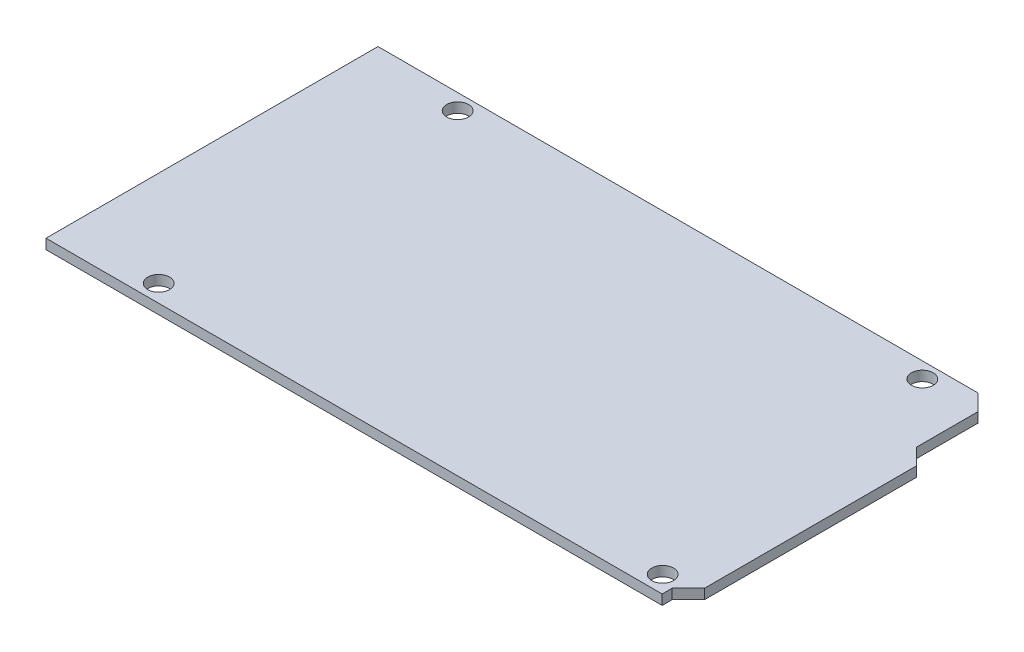
ISO-10303-21;
HEADER;
FILE_DESCRIPTION(('STEP AP214'),'2;1');
FILE_NAME('part.step','',(''),(''),'','','');
FILE_SCHEMA(('AUTOMOTIVE_DESIGN { 1 0 10303 214 1 1 1 1 }'));
ENDSEC;
DATA;
#1=APPLICATION_CONTEXT('core data for automotive mechanical design processes');
#2=APPLICATION_PROTOCOL_DEFINITION('international standard','automotive_design',2000,#1);
#3=PRODUCT_CONTEXT('',#1,'mechanical');
#4=PRODUCT('Part','Part','',(#3));
#5=PRODUCT_RELATED_PRODUCT_CATEGORY('part','',(#4));
#6=PRODUCT_DEFINITION_FORMATION('','',#4);
#7=PRODUCT_DEFINITION_CONTEXT('part definition',#1,'design');
#8=PRODUCT_DEFINITION('design','',#6,#7);
#9=PRODUCT_DEFINITION_SHAPE('','',#8);
#10=(LENGTH_UNIT() NAMED_UNIT(*) SI_UNIT(.MILLI.,.METRE.));
#11=(NAMED_UNIT(*) PLANE_ANGLE_UNIT() SI_UNIT($,.RADIAN.));
#12=(NAMED_UNIT(*) SI_UNIT($,.STERADIAN.) SOLID_ANGLE_UNIT());
#13=UNCERTAINTY_MEASURE_WITH_UNIT(LENGTH_MEASURE(1.E-05),#10,'distance_accuracy_value','');
#14=(GEOMETRIC_REPRESENTATION_CONTEXT(3) GLOBAL_UNCERTAINTY_ASSIGNED_CONTEXT((#13)) GLOBAL_UNIT_ASSIGNED_CONTEXT((#10,
#11,#12)) REPRESENTATION_CONTEXT('',''));
#15=CARTESIAN_POINT('',(0.,0.,0.));
#16=DIRECTION('',(0.,0.,1.));
#17=DIRECTION('',(1.,0.,0.));
#18=AXIS2_PLACEMENT_3D('',#15,#16,#17);
#19=CARTESIAN_POINT('',(48.2000000000001,1.6,25.0700000000001));
#20=DIRECTION('',(-0.707106781186566,0.,-0.707106781186529));
#21=DIRECTION('',(-0.707106781186529,0.,0.707106781186566));
#22=AXIS2_PLACEMENT_3D('',#19,#20,#21);
#23=PLANE('',#22);
#24=DIRECTION('',(0.707106781186529,0.,-0.707106781186566));
#25=VECTOR('',#24,1.);
#26=CARTESIAN_POINT('',(48.2000000000001,0.,25.0700000000001));
#27=LINE('',#26,#25);
#28=CARTESIAN_POINT('',(48.2000000000001,0.,25.0700000000001));
#29=VERTEX_POINT('',#28);
#30=CARTESIAN_POINT('',(50.8,0.,22.47));
#31=VERTEX_POINT('',#30);
#32=EDGE_CURVE('E142',#29,#31,#27,.T.);
#33=ORIENTED_EDGE('',*,*,#32,.T.);
#34=DIRECTION('',(0.,-1.,0.));
#35=VECTOR('',#34,1.);
#36=CARTESIAN_POINT('',(50.8,1.6,22.47));
#37=LINE('',#36,#35);
#38=CARTESIAN_POINT('',(50.8,1.6,22.47));
#39=VERTEX_POINT('',#38);
#40=EDGE_CURVE('E11',#39,#31,#37,.T.);
#41=ORIENTED_EDGE('',*,*,#40,.F.);
#42=DIRECTION('',(0.707106781186529,0.,-0.707106781186566));
#43=VECTOR('',#42,1.);
#44=CARTESIAN_POINT('',(48.2000000000001,1.6,25.0700000000001));
#45=LINE('',#44,#43);
#46=CARTESIAN_POINT('',(48.2000000000001,1.6,25.0700000000001));
#47=VERTEX_POINT('',#46);
#48=EDGE_CURVE('E159',#47,#39,#45,.T.);
#49=ORIENTED_EDGE('',*,*,#48,.F.);
#50=DIRECTION('',(0.,-1.,0.));
#51=VECTOR('',#50,1.);
#52=CARTESIAN_POINT('',(48.2000000000001,1.6,25.0700000000001));
#53=LINE('',#52,#51);
#54=EDGE_CURVE('E138',#47,#29,#53,.T.);
#55=ORIENTED_EDGE('',*,*,#54,.T.);
#56=EDGE_LOOP('',(#33,#41,#49,#55));
#57=FACE_BOUND('',#56,.T.);
#58=ADVANCED_FACE('F38',(#57),#23,.F.);
#59=CARTESIAN_POINT('',(50.8,1.6,22.47));
#60=DIRECTION('',(-1.,0.,0.));
#61=DIRECTION('',(0.,0.,1.));
#62=AXIS2_PLACEMENT_3D('',#59,#60,#61);
#63=PLANE('',#62);
#64=DIRECTION('',(0.,0.,-1.));
#65=VECTOR('',#64,1.);
#66=CARTESIAN_POINT('',(50.8,0.,22.47));
#67=LINE('',#66,#65);
#68=CARTESIAN_POINT('',(50.8,0.,-11.5868711410477));
#69=VERTEX_POINT('',#68);
#70=EDGE_CURVE('E145',#31,#69,#67,.T.);
#71=ORIENTED_EDGE('',*,*,#70,.T.);
#72=DIRECTION('',(0.,-1.,0.));
#73=VECTOR('',#72,1.);
#74=CARTESIAN_POINT('',(50.8,1.6,-11.5868711410477));
#75=LINE('',#74,#73);
#76=CARTESIAN_POINT('',(50.8,1.6,-11.5868711410477));
#77=VERTEX_POINT('',#76);
#78=EDGE_CURVE('E47',#77,#69,#75,.T.);
#79=ORIENTED_EDGE('',*,*,#78,.F.);
#80=DIRECTION('',(0.,0.,-1.));
#81=VECTOR('',#80,1.);
#82=CARTESIAN_POINT('',(50.8,1.6,22.47));
#83=LINE('',#82,#81);
#84=EDGE_CURVE('E102',#39,#77,#83,.T.);
#85=ORIENTED_EDGE('',*,*,#84,.F.);
#86=ORIENTED_EDGE('',*,*,#40,.T.);
#87=EDGE_LOOP('',(#71,#79,#85,#86));
#88=FACE_BOUND('',#87,.T.);
#89=ADVANCED_FACE('F234',(#88),#63,.F.);
#90=CARTESIAN_POINT('',(50.8,1.6,-11.5868711410477));
#91=DIRECTION('',(-0.707106781186548,0.,0.707106781186548));
#92=DIRECTION('',(0.707106781186548,0.,0.707106781186548));
#93=AXIS2_PLACEMENT_3D('',#90,#91,#92);
#94=PLANE('',#93);
#95=DIRECTION('',(-0.707106781186547,0.,-0.707106781186547));
#96=VECTOR('',#95,1.);
#97=CARTESIAN_POINT('',(50.8,0.,-11.5868711410477));
#98=LINE('',#97,#96);
#99=CARTESIAN_POINT('',(48.2,0.,-14.1868711410477));
#100=VERTEX_POINT('',#99);
#101=EDGE_CURVE('E148',#69,#100,#98,.T.);
#102=ORIENTED_EDGE('',*,*,#101,.T.);
#103=DIRECTION('',(0.,-1.,0.));
#104=VECTOR('',#103,1.);
#105=CARTESIAN_POINT('',(48.2,1.6,-14.1868711410477));
#106=LINE('',#105,#104);
#107=CARTESIAN_POINT('',(48.2,1.6,-14.1868711410477));
#108=VERTEX_POINT('',#107);
#109=EDGE_CURVE('E169',#108,#100,#106,.T.);
#110=ORIENTED_EDGE('',*,*,#109,.F.);
#111=DIRECTION('',(-0.707106781186547,0.,-0.707106781186547));
#112=VECTOR('',#111,1.);
#113=CARTESIAN_POINT('',(50.8,1.6,-11.5868711410477));
#114=LINE('',#113,#112);
#115=EDGE_CURVE('E199',#77,#108,#114,.T.);
#116=ORIENTED_EDGE('',*,*,#115,.F.);
#117=ORIENTED_EDGE('',*,*,#78,.T.);
#118=EDGE_LOOP('',(#102,#110,#116,#117));
#119=FACE_BOUND('',#118,.T.);
#120=ADVANCED_FACE('F238',(#119),#94,.F.);
#121=CARTESIAN_POINT('',(48.2,1.6,-24.0700000000001));
#122=DIRECTION('',(-1.,0.,0.));
#123=DIRECTION('',(0.,0.,1.));
#124=AXIS2_PLACEMENT_3D('',#121,#122,#123);
#125=PLANE('',#124);
#126=DIRECTION('',(0.,0.,-1.));
#127=VECTOR('',#126,1.);
#128=CARTESIAN_POINT('',(48.2,0.,-24.0700000000001));
#129=LINE('',#128,#127);
#130=CARTESIAN_POINT('',(48.2,0.,-24.0700000000001));
#131=VERTEX_POINT('',#130);
#132=EDGE_CURVE('E150',#100,#131,#129,.T.);
#133=ORIENTED_EDGE('',*,*,#132,.T.);
#134=DIRECTION('',(0.,-1.,0.));
#135=VECTOR('',#134,1.);
#136=CARTESIAN_POINT('',(48.2,1.6,-24.0700000000001));
#137=LINE('',#136,#135);
#138=CARTESIAN_POINT('',(48.2,1.6,-24.0700000000001));
#139=VERTEX_POINT('',#138);
#140=EDGE_CURVE('E166',#139,#131,#137,.T.);
#141=ORIENTED_EDGE('',*,*,#140,.F.);
#142=DIRECTION('',(0.,0.,-1.));
#143=VECTOR('',#142,1.);
#144=CARTESIAN_POINT('',(48.2,1.6,-24.0700000000001));
#145=LINE('',#144,#143);
#146=EDGE_CURVE('E201',#108,#139,#145,.T.);
#147=ORIENTED_EDGE('',*,*,#146,.F.);
#148=ORIENTED_EDGE('',*,*,#109,.T.);
#149=EDGE_LOOP('',(#133,#141,#147,#148));
#150=FACE_BOUND('',#149,.T.);
#151=ADVANCED_FACE('F242',(#150),#125,.F.);
#152=CARTESIAN_POINT('',(45.6,1.6,-26.67));
#153=DIRECTION('',(-0.707106781186543,0.,0.707106781186552));
#154=DIRECTION('',(0.707106781186552,0.,0.707106781186543));
#155=AXIS2_PLACEMENT_3D('',#152,#153,#154);
#156=PLANE('',#155);
#157=DIRECTION('',(-0.707106781186552,0.,-0.707106781186543));
#158=VECTOR('',#157,1.);
#159=CARTESIAN_POINT('',(45.6,0.,-26.67));
#160=LINE('',#159,#158);
#161=CARTESIAN_POINT('',(45.6,0.,-26.67));
#162=VERTEX_POINT('',#161);
#163=EDGE_CURVE('E152',#131,#162,#160,.T.);
#164=ORIENTED_EDGE('',*,*,#163,.T.);
#165=DIRECTION('',(0.,-1.,0.));
#166=VECTOR('',#165,1.);
#167=CARTESIAN_POINT('',(45.6,1.6,-26.67));
#168=LINE('',#167,#166);
#169=CARTESIAN_POINT('',(45.6,1.6,-26.67));
#170=VERTEX_POINT('',#169);
#171=EDGE_CURVE('E163',#170,#162,#168,.T.);
#172=ORIENTED_EDGE('',*,*,#171,.F.);
#173=DIRECTION('',(-0.707106781186552,0.,-0.707106781186543));
#174=VECTOR('',#173,1.);
#175=CARTESIAN_POINT('',(45.6,1.6,-26.67));
#176=LINE('',#175,#174);
#177=EDGE_CURVE('E203',#139,#170,#176,.T.);
#178=ORIENTED_EDGE('',*,*,#177,.F.);
#179=ORIENTED_EDGE('',*,*,#140,.T.);
#180=EDGE_LOOP('',(#164,#172,#178,#179));
#181=FACE_BOUND('',#180,.T.);
#182=ADVANCED_FACE('F209',(#181),#156,.F.);
#183=CARTESIAN_POINT('',(45.6,1.6,-26.67));
#184=DIRECTION('',(0.,0.,1.));
#185=DIRECTION('',(1.,0.,0.));
#186=AXIS2_PLACEMENT_3D('',#183,#184,#185);
#187=PLANE('',#186);
#188=DIRECTION('',(-1.,0.,0.));
#189=VECTOR('',#188,1.);
#190=CARTESIAN_POINT('',(45.6,0.,-26.67));
#191=LINE('',#190,#189);
#192=CARTESIAN_POINT('',(-50.8,0.,-26.67));
#193=VERTEX_POINT('',#192);
#194=EDGE_CURVE('E154',#162,#193,#191,.T.);
#195=ORIENTED_EDGE('',*,*,#194,.T.);
#196=DIRECTION('',(0.,-1.,0.));
#197=VECTOR('',#196,1.);
#198=CARTESIAN_POINT('',(-50.8,1.6,-26.67));
#199=LINE('',#198,#197);
#200=CARTESIAN_POINT('',(-50.8,1.6,-26.67));
#201=VERTEX_POINT('',#200);
#202=EDGE_CURVE('E133',#201,#193,#199,.T.);
#203=ORIENTED_EDGE('',*,*,#202,.F.);
#204=DIRECTION('',(-1.,0.,0.));
#205=VECTOR('',#204,1.);
#206=CARTESIAN_POINT('',(45.6,1.6,-26.67));
#207=LINE('',#206,#205);
#208=EDGE_CURVE('E124',#170,#201,#207,.T.);
#209=ORIENTED_EDGE('',*,*,#208,.F.);
#210=ORIENTED_EDGE('',*,*,#171,.T.);
#211=EDGE_LOOP('',(#195,#203,#209,#210));
#212=FACE_BOUND('',#211,.T.);
#213=ADVANCED_FACE('F213',(#212),#187,.F.);
#214=CARTESIAN_POINT('',(-50.8,1.6,26.67));
#215=DIRECTION('',(1.,0.,0.));
#216=DIRECTION('',(0.,0.,-1.));
#217=AXIS2_PLACEMENT_3D('',#214,#215,#216);
#218=PLANE('',#217);
#219=DIRECTION('',(0.,0.,1.));
#220=VECTOR('',#219,1.);
#221=CARTESIAN_POINT('',(-50.8,0.,26.67));
#222=LINE('',#221,#220);
#223=CARTESIAN_POINT('',(-50.8,0.,26.67));
#224=VERTEX_POINT('',#223);
#225=EDGE_CURVE('E132',#193,#224,#222,.T.);
#226=ORIENTED_EDGE('',*,*,#225,.T.);
#227=DIRECTION('',(0.,-1.,0.));
#228=VECTOR('',#227,1.);
#229=CARTESIAN_POINT('',(-50.8,1.6,26.67));
#230=LINE('',#229,#228);
#231=CARTESIAN_POINT('',(-50.8,1.6,26.67));
#232=VERTEX_POINT('',#231);
#233=EDGE_CURVE('E129',#232,#224,#230,.T.);
#234=ORIENTED_EDGE('',*,*,#233,.F.);
#235=DIRECTION('',(0.,0.,1.));
#236=VECTOR('',#235,1.);
#237=CARTESIAN_POINT('',(-50.8,1.6,26.67));
#238=LINE('',#237,#236);
#239=EDGE_CURVE('E118',#201,#232,#238,.T.);
#240=ORIENTED_EDGE('',*,*,#239,.F.);
#241=ORIENTED_EDGE('',*,*,#202,.T.);
#242=EDGE_LOOP('',(#226,#234,#240,#241));
#243=FACE_BOUND('',#242,.T.);
#244=ADVANCED_FACE('F130',(#243),#218,.F.);
#245=CARTESIAN_POINT('',(48.2000000000001,1.6,26.6700000000001));
#246=DIRECTION('',(0.,0.,-1.));
#247=DIRECTION('',(-1.,0.,0.));
#248=AXIS2_PLACEMENT_3D('',#245,#246,#247);
#249=PLANE('',#248);
#250=DIRECTION('',(1.,0.,0.));
#251=VECTOR('',#250,1.);
#252=CARTESIAN_POINT('',(48.2000000000001,0.,26.6700000000001));
#253=LINE('',#252,#251);
#254=CARTESIAN_POINT('',(48.2000000000001,0.,26.6700000000001));
#255=VERTEX_POINT('',#254);
#256=EDGE_CURVE('E88',#224,#255,#253,.T.);
#257=ORIENTED_EDGE('',*,*,#256,.T.);
#258=DIRECTION('',(0.,-1.,0.));
#259=VECTOR('',#258,1.);
#260=CARTESIAN_POINT('',(48.2000000000001,1.6,26.6700000000001));
#261=LINE('',#260,#259);
#262=CARTESIAN_POINT('',(48.2000000000001,1.6,26.6700000000001));
#263=VERTEX_POINT('',#262);
#264=EDGE_CURVE('E134',#263,#255,#261,.T.);
#265=ORIENTED_EDGE('',*,*,#264,.F.);
#266=DIRECTION('',(1.,0.,0.));
#267=VECTOR('',#266,1.);
#268=CARTESIAN_POINT('',(48.2000000000001,1.6,26.6700000000001));
#269=LINE('',#268,#267);
#270=EDGE_CURVE('E122',#232,#263,#269,.T.);
#271=ORIENTED_EDGE('',*,*,#270,.F.);
#272=ORIENTED_EDGE('',*,*,#233,.T.);
#273=EDGE_LOOP('',(#257,#265,#271,#272));
#274=FACE_BOUND('',#273,.T.);
#275=ADVANCED_FACE('F136',(#274),#249,.F.);
#276=CARTESIAN_POINT('',(48.2000000000001,1.6,25.0700000000001));
#277=DIRECTION('',(-1.,0.,0.));
#278=DIRECTION('',(0.,0.,1.));
#279=AXIS2_PLACEMENT_3D('',#276,#277,#278);
#280=PLANE('',#279);
#281=DIRECTION('',(0.,0.,-1.));
#282=VECTOR('',#281,1.);
#283=CARTESIAN_POINT('',(48.2000000000001,0.,25.0700000000001));
#284=LINE('',#283,#282);
#285=EDGE_CURVE('E94',#255,#29,#284,.T.);
#286=ORIENTED_EDGE('',*,*,#285,.T.);
#287=ORIENTED_EDGE('',*,*,#54,.F.);
#288=DIRECTION('',(0.,0.,-1.));
#289=VECTOR('',#288,1.);
#290=CARTESIAN_POINT('',(48.2000000000001,1.6,25.0700000000001));
#291=LINE('',#290,#289);
#292=EDGE_CURVE('E56',#263,#47,#291,.T.);
#293=ORIENTED_EDGE('',*,*,#292,.F.);
#294=ORIENTED_EDGE('',*,*,#264,.T.);
#295=EDGE_LOOP('',(#286,#287,#293,#294));
#296=FACE_BOUND('',#295,.T.);
#297=ADVANCED_FACE('F221',(#296),#280,.F.);
#298=CARTESIAN_POINT('',(67.8284355705234,1.6,5.44156442947573));
#299=DIRECTION('',(0.,1.,0.));
#300=DIRECTION('',(0.,0.,1.));
#301=AXIS2_PLACEMENT_3D('',#298,#299,#300);
#302=PLANE('',#301);
#303=CARTESIAN_POINT('',(-35.4684388441213,1.6,-24.1322547617535));
#304=DIRECTION('',(0.,1.,0.));
#305=DIRECTION('',(0.,0.,1.));
#306=AXIS2_PLACEMENT_3D('',#303,#304,#305);
#307=CIRCLE('',#306,1.75);
#308=CARTESIAN_POINT('',(-35.4684388441213,1.6,-22.3822547617534));
#309=VERTEX_POINT('',#308);
#310=EDGE_CURVE('E192',#309,#309,#307,.T.);
#311=ORIENTED_EDGE('',*,*,#310,.F.);
#312=EDGE_LOOP('',(#311));
#313=FACE_BOUND('',#312,.T.);
#314=CARTESIAN_POINT('',(-35.4684388441213,1.6,23.8988818579047));
#315=DIRECTION('',(0.,1.,0.));
#316=DIRECTION('',(0.,0.,1.));
#317=AXIS2_PLACEMENT_3D('',#314,#315,#316);
#318=CIRCLE('',#317,1.75);
#319=CARTESIAN_POINT('',(-35.4684388441213,1.6,25.6488818579047));
#320=VERTEX_POINT('',#319);
#321=EDGE_CURVE('E182',#320,#320,#318,.T.);
#322=ORIENTED_EDGE('',*,*,#321,.F.);
#323=EDGE_LOOP('',(#322));
#324=FACE_BOUND('',#323,.T.);
#325=CARTESIAN_POINT('',(45.5029282232194,1.6,23.8988818579047));
#326=DIRECTION('',(0.,1.,0.));
#327=DIRECTION('',(0.,0.,1.));
#328=AXIS2_PLACEMENT_3D('',#325,#326,#327);
#329=CIRCLE('',#328,1.75);
#330=CARTESIAN_POINT('',(45.5029282232194,1.6,25.6488818579047));
#331=VERTEX_POINT('',#330);
#332=EDGE_CURVE('E179',#331,#331,#329,.T.);
#333=ORIENTED_EDGE('',*,*,#332,.F.);
#334=EDGE_LOOP('',(#333));
#335=FACE_BOUND('',#334,.T.);
#336=CARTESIAN_POINT('',(39.195511541846,1.6,-24.1322547617535));
#337=DIRECTION('',(0.,1.,0.));
#338=DIRECTION('',(0.,0.,1.));
#339=AXIS2_PLACEMENT_3D('',#336,#337,#338);
#340=CIRCLE('',#339,1.75);
#341=CARTESIAN_POINT('',(39.195511541846,1.6,-22.3822547617534));
#342=VERTEX_POINT('',#341);
#343=EDGE_CURVE('E176',#342,#342,#340,.T.);
#344=ORIENTED_EDGE('',*,*,#343,.F.);
#345=EDGE_LOOP('',(#344));
#346=FACE_BOUND('',#345,.T.);
#347=ORIENTED_EDGE('',*,*,#48,.T.);
#348=ORIENTED_EDGE('',*,*,#84,.T.);
#349=ORIENTED_EDGE('',*,*,#115,.T.);
#350=ORIENTED_EDGE('',*,*,#146,.T.);
#351=ORIENTED_EDGE('',*,*,#177,.T.);
#352=ORIENTED_EDGE('',*,*,#208,.T.);
#353=ORIENTED_EDGE('',*,*,#239,.T.);
#354=ORIENTED_EDGE('',*,*,#270,.T.);
#355=ORIENTED_EDGE('',*,*,#292,.T.);
#356=EDGE_LOOP('',(#347,#348,#349,#350,#351,#352,#353,#354,#355));
#357=FACE_BOUND('',#356,.T.);
#358=ADVANCED_FACE('F120',(#313,#324,#335,#346,#357),#302,.T.);
#359=CARTESIAN_POINT('',(67.8284355705234,0.,5.44156442947573));
#360=DIRECTION('',(0.,1.,0.));
#361=DIRECTION('',(0.,0.,1.));
#362=AXIS2_PLACEMENT_3D('',#359,#360,#361);
#363=PLANE('',#362);
#364=CARTESIAN_POINT('',(-35.4684388441213,0.,-24.1322547617535));
#365=DIRECTION('',(0.,1.,0.));
#366=DIRECTION('',(0.,0.,1.));
#367=AXIS2_PLACEMENT_3D('',#364,#365,#366);
#368=CIRCLE('',#367,1.75);
#369=CARTESIAN_POINT('',(-35.4684388441213,0.,-22.3822547617534));
#370=VERTEX_POINT('',#369);
#371=EDGE_CURVE('E41',#370,#370,#368,.T.);
#372=ORIENTED_EDGE('',*,*,#371,.T.);
#373=EDGE_LOOP('',(#372));
#374=FACE_BOUND('',#373,.T.);
#375=CARTESIAN_POINT('',(-35.4684388441213,0.,23.8988818579047));
#376=DIRECTION('',(0.,1.,0.));
#377=DIRECTION('',(0.,0.,1.));
#378=AXIS2_PLACEMENT_3D('',#375,#376,#377);
#379=CIRCLE('',#378,1.75);
#380=CARTESIAN_POINT('',(-35.4684388441213,0.,25.6488818579047));
#381=VERTEX_POINT('',#380);
#382=EDGE_CURVE('E180',#381,#381,#379,.T.);
#383=ORIENTED_EDGE('',*,*,#382,.T.);
#384=EDGE_LOOP('',(#383));
#385=FACE_BOUND('',#384,.T.);
#386=CARTESIAN_POINT('',(45.5029282232194,0.,23.8988818579047));
#387=DIRECTION('',(0.,1.,0.));
#388=DIRECTION('',(0.,0.,1.));
#389=AXIS2_PLACEMENT_3D('',#386,#387,#388);
#390=CIRCLE('',#389,1.75);
#391=CARTESIAN_POINT('',(45.5029282232194,0.,25.6488818579047));
#392=VERTEX_POINT('',#391);
#393=EDGE_CURVE('E177',#392,#392,#390,.T.);
#394=ORIENTED_EDGE('',*,*,#393,.T.);
#395=EDGE_LOOP('',(#394));
#396=FACE_BOUND('',#395,.T.);
#397=CARTESIAN_POINT('',(39.195511541846,0.,-24.1322547617535));
#398=DIRECTION('',(0.,1.,0.));
#399=DIRECTION('',(0.,0.,1.));
#400=AXIS2_PLACEMENT_3D('',#397,#398,#399);
#401=CIRCLE('',#400,1.75);
#402=CARTESIAN_POINT('',(39.195511541846,0.,-22.3822547617534));
#403=VERTEX_POINT('',#402);
#404=EDGE_CURVE('E146',#403,#403,#401,.T.);
#405=ORIENTED_EDGE('',*,*,#404,.T.);
#406=EDGE_LOOP('',(#405));
#407=FACE_BOUND('',#406,.T.);
#408=ORIENTED_EDGE('',*,*,#32,.F.);
#409=ORIENTED_EDGE('',*,*,#285,.F.);
#410=ORIENTED_EDGE('',*,*,#256,.F.);
#411=ORIENTED_EDGE('',*,*,#225,.F.);
#412=ORIENTED_EDGE('',*,*,#194,.F.);
#413=ORIENTED_EDGE('',*,*,#163,.F.);
#414=ORIENTED_EDGE('',*,*,#132,.F.);
#415=ORIENTED_EDGE('',*,*,#101,.F.);
#416=ORIENTED_EDGE('',*,*,#70,.F.);
#417=EDGE_LOOP('',(#408,#409,#410,#411,#412,#413,#414,#415,#416));
#418=FACE_BOUND('',#417,.T.);
#419=ADVANCED_FACE('F216',(#374,#385,#396,#407,#418),#363,.F.);
#420=CARTESIAN_POINT('',(39.195511541846,1.6,-24.1322547617535));
#421=DIRECTION('',(0.,1.,0.));
#422=DIRECTION('',(0.,0.,1.));
#423=AXIS2_PLACEMENT_3D('',#420,#421,#422);
#424=CYLINDRICAL_SURFACE('',#423,1.75);
#425=ORIENTED_EDGE('',*,*,#343,.T.);
#426=EDGE_LOOP('',(#425));
#427=FACE_BOUND('',#426,.T.);
#428=ORIENTED_EDGE('',*,*,#404,.F.);
#429=EDGE_LOOP('',(#428));
#430=FACE_BOUND('',#429,.T.);
#431=ADVANCED_FACE('F279',(#427,#430),#424,.F.);
#432=CARTESIAN_POINT('',(45.5029282232194,1.6,23.8988818579047));
#433=DIRECTION('',(0.,1.,0.));
#434=DIRECTION('',(0.,0.,1.));
#435=AXIS2_PLACEMENT_3D('',#432,#433,#434);
#436=CYLINDRICAL_SURFACE('',#435,1.75);
#437=ORIENTED_EDGE('',*,*,#332,.T.);
#438=EDGE_LOOP('',(#437));
#439=FACE_BOUND('',#438,.T.);
#440=ORIENTED_EDGE('',*,*,#393,.F.);
#441=EDGE_LOOP('',(#440));
#442=FACE_BOUND('',#441,.T.);
#443=ADVANCED_FACE('F287',(#439,#442),#436,.F.);
#444=CARTESIAN_POINT('',(-35.4684388441213,1.6,23.8988818579047));
#445=DIRECTION('',(0.,1.,0.));
#446=DIRECTION('',(0.,0.,1.));
#447=AXIS2_PLACEMENT_3D('',#444,#445,#446);
#448=CYLINDRICAL_SURFACE('',#447,1.75);
#449=ORIENTED_EDGE('',*,*,#321,.T.);
#450=EDGE_LOOP('',(#449));
#451=FACE_BOUND('',#450,.T.);
#452=ORIENTED_EDGE('',*,*,#382,.F.);
#453=EDGE_LOOP('',(#452));
#454=FACE_BOUND('',#453,.T.);
#455=ADVANCED_FACE('F297',(#451,#454),#448,.F.);
#456=CARTESIAN_POINT('',(-35.4684388441213,1.6,-24.1322547617535));
#457=DIRECTION('',(0.,1.,0.));
#458=DIRECTION('',(0.,0.,1.));
#459=AXIS2_PLACEMENT_3D('',#456,#457,#458);
#460=CYLINDRICAL_SURFACE('',#459,1.75);
#461=ORIENTED_EDGE('',*,*,#310,.T.);
#462=EDGE_LOOP('',(#461));
#463=FACE_BOUND('',#462,.T.);
#464=ORIENTED_EDGE('',*,*,#371,.F.);
#465=EDGE_LOOP('',(#464));
#466=FACE_BOUND('',#465,.T.);
#467=ADVANCED_FACE('F307',(#463,#466),#460,.F.);
#468=CLOSED_SHELL('',(#58,#89,#120,#151,#182,#213,#244,#275,#297,#358,#419,#431,#443,#455,#467));
#469=MANIFOLD_SOLID_BREP('B2',#468);
#470=ADVANCED_BREP_SHAPE_REPRESENTATION('',(#18,#469),#14);
#471=SHAPE_DEFINITION_REPRESENTATION(#9,#470);
ENDSEC;
END-ISO-10303-21;
